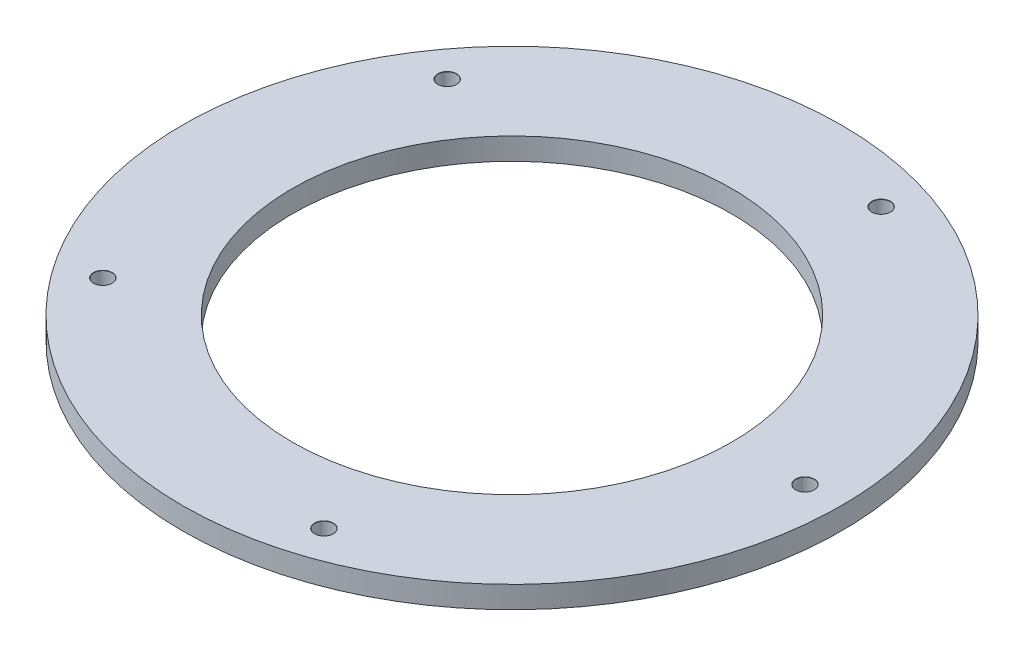
ISO-10303-21;
HEADER;
FILE_DESCRIPTION(('STEP AP214'),'2;1');
FILE_NAME('part.step','',(''),(''),'','','');
FILE_SCHEMA(('AUTOMOTIVE_DESIGN { 1 0 10303 214 1 1 1 1 }'));
ENDSEC;
DATA;
#1=APPLICATION_CONTEXT('core data for automotive mechanical design processes');
#2=APPLICATION_PROTOCOL_DEFINITION('international standard','automotive_design',2000,#1);
#3=PRODUCT_CONTEXT('',#1,'mechanical');
#4=PRODUCT('Part','Part','',(#3));
#5=PRODUCT_RELATED_PRODUCT_CATEGORY('part','',(#4));
#6=PRODUCT_DEFINITION_FORMATION('','',#4);
#7=PRODUCT_DEFINITION_CONTEXT('part definition',#1,'design');
#8=PRODUCT_DEFINITION('design','',#6,#7);
#9=PRODUCT_DEFINITION_SHAPE('','',#8);
#10=(LENGTH_UNIT() NAMED_UNIT(*) SI_UNIT(.MILLI.,.METRE.));
#11=(NAMED_UNIT(*) PLANE_ANGLE_UNIT() SI_UNIT($,.RADIAN.));
#12=(NAMED_UNIT(*) SI_UNIT($,.STERADIAN.) SOLID_ANGLE_UNIT());
#13=UNCERTAINTY_MEASURE_WITH_UNIT(LENGTH_MEASURE(1.E-05),#10,'distance_accuracy_value','');
#14=(GEOMETRIC_REPRESENTATION_CONTEXT(3) GLOBAL_UNCERTAINTY_ASSIGNED_CONTEXT((#13)) GLOBAL_UNIT_ASSIGNED_CONTEXT((#10,
#11,#12)) REPRESENTATION_CONTEXT('',''));
#15=CARTESIAN_POINT('',(0.,0.,0.));
#16=DIRECTION('',(0.,0.,1.));
#17=DIRECTION('',(1.,0.,0.));
#18=AXIS2_PLACEMENT_3D('',#15,#16,#17);
#19=CARTESIAN_POINT('',(0.,3.,0.));
#20=DIRECTION('',(0.,-1.,0.));
#21=DIRECTION('',(0.,0.,-1.));
#22=AXIS2_PLACEMENT_3D('',#19,#20,#21);
#23=CYLINDRICAL_SURFACE('',#22,45.);
#24=CARTESIAN_POINT('',(0.,3.,0.));
#25=DIRECTION('',(0.,1.,0.));
#26=DIRECTION('',(0.,0.,1.));
#27=AXIS2_PLACEMENT_3D('',#24,#25,#26);
#28=CIRCLE('',#27,45.);
#29=CARTESIAN_POINT('',(0.,3.,45.));
#30=VERTEX_POINT('',#29);
#31=EDGE_CURVE('E10',#30,#30,#28,.T.);
#32=ORIENTED_EDGE('',*,*,#31,.F.);
#33=EDGE_LOOP('',(#32));
#34=FACE_BOUND('',#33,.T.);
#35=CARTESIAN_POINT('',(0.,0.,0.));
#36=DIRECTION('',(0.,1.,0.));
#37=DIRECTION('',(0.,0.,1.));
#38=AXIS2_PLACEMENT_3D('',#35,#36,#37);
#39=CIRCLE('',#38,45.);
#40=CARTESIAN_POINT('',(0.,0.,45.));
#41=VERTEX_POINT('',#40);
#42=EDGE_CURVE('E44',#41,#41,#39,.T.);
#43=ORIENTED_EDGE('',*,*,#42,.T.);
#44=EDGE_LOOP('',(#43));
#45=FACE_BOUND('',#44,.T.);
#46=ADVANCED_FACE('F41',(#34,#45),#23,.T.);
#47=CARTESIAN_POINT('',(0.,3.,0.));
#48=DIRECTION('',(0.,1.,0.));
#49=DIRECTION('',(0.,0.,1.));
#50=AXIS2_PLACEMENT_3D('',#47,#48,#49);
#51=PLANE('',#50);
#52=CARTESIAN_POINT('',(40.,3.,0.));
#53=DIRECTION('',(0.,1.,0.));
#54=DIRECTION('',(0.,0.,1.));
#55=AXIS2_PLACEMENT_3D('',#52,#53,#54);
#56=CIRCLE('',#55,1.275);
#57=CARTESIAN_POINT('',(40.,3.,1.275));
#58=VERTEX_POINT('',#57);
#59=EDGE_CURVE('E100',#58,#58,#56,.T.);
#60=ORIENTED_EDGE('',*,*,#59,.F.);
#61=EDGE_LOOP('',(#60));
#62=FACE_BOUND('',#61,.T.);
#63=CARTESIAN_POINT('',(12.3606797749979,3.,38.0422606518062));
#64=DIRECTION('',(0.,1.,0.));
#65=DIRECTION('',(0.,0.,1.));
#66=AXIS2_PLACEMENT_3D('',#63,#64,#65);
#67=CIRCLE('',#66,1.275);
#68=CARTESIAN_POINT('',(12.3606797749979,3.,39.3172606518062));
#69=VERTEX_POINT('',#68);
#70=EDGE_CURVE('E91',#69,#69,#67,.T.);
#71=ORIENTED_EDGE('',*,*,#70,.F.);
#72=EDGE_LOOP('',(#71));
#73=FACE_BOUND('',#72,.T.);
#74=CARTESIAN_POINT('',(-32.3606797749979,3.,23.5114100916989));
#75=DIRECTION('',(0.,1.,0.));
#76=DIRECTION('',(0.,0.,1.));
#77=AXIS2_PLACEMENT_3D('',#74,#75,#76);
#78=CIRCLE('',#77,1.275);
#79=CARTESIAN_POINT('',(-32.3606797749979,3.,24.7864100916989));
#80=VERTEX_POINT('',#79);
#81=EDGE_CURVE('E82',#80,#80,#78,.T.);
#82=ORIENTED_EDGE('',*,*,#81,.F.);
#83=EDGE_LOOP('',(#82));
#84=FACE_BOUND('',#83,.T.);
#85=CARTESIAN_POINT('',(-32.3606797749979,3.,-23.5114100916989));
#86=DIRECTION('',(0.,1.,0.));
#87=DIRECTION('',(0.,0.,1.));
#88=AXIS2_PLACEMENT_3D('',#85,#86,#87);
#89=CIRCLE('',#88,1.275);
#90=CARTESIAN_POINT('',(-32.3606797749979,3.,-22.2364100916989));
#91=VERTEX_POINT('',#90);
#92=EDGE_CURVE('E73',#91,#91,#89,.T.);
#93=ORIENTED_EDGE('',*,*,#92,.F.);
#94=EDGE_LOOP('',(#93));
#95=FACE_BOUND('',#94,.T.);
#96=CARTESIAN_POINT('',(12.3606797749979,3.,-38.0422606518062));
#97=DIRECTION('',(0.,1.,0.));
#98=DIRECTION('',(0.,0.,1.));
#99=AXIS2_PLACEMENT_3D('',#96,#97,#98);
#100=CIRCLE('',#99,1.275);
#101=CARTESIAN_POINT('',(12.3606797749979,3.,-36.7672606518062));
#102=VERTEX_POINT('',#101);
#103=EDGE_CURVE('E64',#102,#102,#100,.T.);
#104=ORIENTED_EDGE('',*,*,#103,.F.);
#105=EDGE_LOOP('',(#104));
#106=FACE_BOUND('',#105,.T.);
#107=CARTESIAN_POINT('',(0.,3.,0.));
#108=DIRECTION('',(0.,1.,0.));
#109=DIRECTION('',(0.,0.,1.));
#110=AXIS2_PLACEMENT_3D('',#107,#108,#109);
#111=CIRCLE('',#110,30.);
#112=CARTESIAN_POINT('',(0.,3.,30.));
#113=VERTEX_POINT('',#112);
#114=EDGE_CURVE('E51',#113,#113,#111,.T.);
#115=ORIENTED_EDGE('',*,*,#114,.F.);
#116=EDGE_LOOP('',(#115));
#117=FACE_BOUND('',#116,.T.);
#118=ORIENTED_EDGE('',*,*,#31,.T.);
#119=EDGE_LOOP('',(#118));
#120=FACE_BOUND('',#119,.T.);
#121=ADVANCED_FACE('F106',(#62,#73,#84,#95,#106,#117,#120),#51,.T.);
#122=CARTESIAN_POINT('',(0.,0.,0.));
#123=DIRECTION('',(0.,1.,0.));
#124=DIRECTION('',(0.,0.,1.));
#125=AXIS2_PLACEMENT_3D('',#122,#123,#124);
#126=PLANE('',#125);
#127=CARTESIAN_POINT('',(40.,0.,0.));
#128=DIRECTION('',(0.,1.,0.));
#129=DIRECTION('',(0.,0.,1.));
#130=AXIS2_PLACEMENT_3D('',#127,#128,#129);
#131=CIRCLE('',#130,1.25);
#132=CARTESIAN_POINT('',(40.,0.,1.25));
#133=VERTEX_POINT('',#132);
#134=EDGE_CURVE('E94',#133,#133,#131,.T.);
#135=ORIENTED_EDGE('',*,*,#134,.T.);
#136=EDGE_LOOP('',(#135));
#137=FACE_BOUND('',#136,.T.);
#138=CARTESIAN_POINT('',(12.3606797749979,0.,38.0422606518062));
#139=DIRECTION('',(0.,1.,0.));
#140=DIRECTION('',(0.,0.,1.));
#141=AXIS2_PLACEMENT_3D('',#138,#139,#140);
#142=CIRCLE('',#141,1.25);
#143=CARTESIAN_POINT('',(12.3606797749979,0.,39.2922606518062));
#144=VERTEX_POINT('',#143);
#145=EDGE_CURVE('E85',#144,#144,#142,.T.);
#146=ORIENTED_EDGE('',*,*,#145,.T.);
#147=EDGE_LOOP('',(#146));
#148=FACE_BOUND('',#147,.T.);
#149=CARTESIAN_POINT('',(-32.3606797749979,0.,23.5114100916989));
#150=DIRECTION('',(0.,1.,0.));
#151=DIRECTION('',(0.,0.,1.));
#152=AXIS2_PLACEMENT_3D('',#149,#150,#151);
#153=CIRCLE('',#152,1.25);
#154=CARTESIAN_POINT('',(-32.3606797749979,0.,24.7614100916989));
#155=VERTEX_POINT('',#154);
#156=EDGE_CURVE('E76',#155,#155,#153,.T.);
#157=ORIENTED_EDGE('',*,*,#156,.T.);
#158=EDGE_LOOP('',(#157));
#159=FACE_BOUND('',#158,.T.);
#160=CARTESIAN_POINT('',(-32.3606797749979,0.,-23.5114100916989));
#161=DIRECTION('',(0.,1.,0.));
#162=DIRECTION('',(0.,0.,1.));
#163=AXIS2_PLACEMENT_3D('',#160,#161,#162);
#164=CIRCLE('',#163,1.25);
#165=CARTESIAN_POINT('',(-32.3606797749979,0.,-22.2614100916989));
#166=VERTEX_POINT('',#165);
#167=EDGE_CURVE('E67',#166,#166,#164,.T.);
#168=ORIENTED_EDGE('',*,*,#167,.T.);
#169=EDGE_LOOP('',(#168));
#170=FACE_BOUND('',#169,.T.);
#171=CARTESIAN_POINT('',(12.3606797749979,0.,-38.0422606518062));
#172=DIRECTION('',(0.,1.,0.));
#173=DIRECTION('',(0.,0.,1.));
#174=AXIS2_PLACEMENT_3D('',#171,#172,#173);
#175=CIRCLE('',#174,1.25);
#176=CARTESIAN_POINT('',(12.3606797749979,0.,-36.7922606518062));
#177=VERTEX_POINT('',#176);
#178=EDGE_CURVE('E58',#177,#177,#175,.T.);
#179=ORIENTED_EDGE('',*,*,#178,.T.);
#180=EDGE_LOOP('',(#179));
#181=FACE_BOUND('',#180,.T.);
#182=CARTESIAN_POINT('',(0.,0.,0.));
#183=DIRECTION('',(0.,1.,0.));
#184=DIRECTION('',(0.,0.,1.));
#185=AXIS2_PLACEMENT_3D('',#182,#183,#184);
#186=CIRCLE('',#185,30.);
#187=CARTESIAN_POINT('',(0.,0.,30.));
#188=VERTEX_POINT('',#187);
#189=EDGE_CURVE('E55',#188,#188,#186,.T.);
#190=ORIENTED_EDGE('',*,*,#189,.T.);
#191=EDGE_LOOP('',(#190));
#192=FACE_BOUND('',#191,.T.);
#193=ORIENTED_EDGE('',*,*,#42,.F.);
#194=EDGE_LOOP('',(#193));
#195=FACE_BOUND('',#194,.T.);
#196=ADVANCED_FACE('F109',(#137,#148,#159,#170,#181,#192,#195),#126,.F.);
#197=CARTESIAN_POINT('',(0.,0.,0.));
#198=DIRECTION('',(0.,1.,0.));
#199=DIRECTION('',(0.,0.,1.));
#200=AXIS2_PLACEMENT_3D('',#197,#198,#199);
#201=CYLINDRICAL_SURFACE('',#200,30.);
#202=ORIENTED_EDGE('',*,*,#114,.T.);
#203=EDGE_LOOP('',(#202));
#204=FACE_BOUND('',#203,.T.);
#205=ORIENTED_EDGE('',*,*,#189,.F.);
#206=EDGE_LOOP('',(#205));
#207=FACE_BOUND('',#206,.T.);
#208=ADVANCED_FACE('F121',(#204,#207),#201,.F.);
#209=CARTESIAN_POINT('',(12.3606797749979,3.,-38.0422606518062));
#210=DIRECTION('',(0.,1.,0.));
#211=DIRECTION('',(0.,0.,1.));
#212=AXIS2_PLACEMENT_3D('',#209,#210,#211);
#213=CYLINDRICAL_SURFACE('',#212,1.25);
#214=ORIENTED_EDGE('',*,*,#178,.F.);
#215=EDGE_LOOP('',(#214));
#216=FACE_BOUND('',#215,.T.);
#217=CARTESIAN_POINT('',(12.3606797749979,2.975,-38.0422606518062));
#218=DIRECTION('',(0.,1.,0.));
#219=DIRECTION('',(0.,0.,1.));
#220=AXIS2_PLACEMENT_3D('',#217,#218,#219);
#221=CIRCLE('',#220,1.25);
#222=CARTESIAN_POINT('',(12.3606797749979,2.975,-36.7922606518062));
#223=VERTEX_POINT('',#222);
#224=EDGE_CURVE('E61',#223,#223,#221,.T.);
#225=ORIENTED_EDGE('',*,*,#224,.T.);
#226=EDGE_LOOP('',(#225));
#227=FACE_BOUND('',#226,.T.);
#228=ADVANCED_FACE('F124',(#216,#227),#213,.F.);
#229=CARTESIAN_POINT('',(12.3606797749979,3.,-38.0422606518062));
#230=DIRECTION('',(0.,1.,0.));
#231=DIRECTION('',(0.,0.,1.));
#232=AXIS2_PLACEMENT_3D('',#229,#230,#231);
#233=CONICAL_SURFACE('',#232,1.275,0.785398163397457);
#234=ORIENTED_EDGE('',*,*,#224,.F.);
#235=EDGE_LOOP('',(#234));
#236=FACE_BOUND('',#235,.T.);
#237=ORIENTED_EDGE('',*,*,#103,.T.);
#238=EDGE_LOOP('',(#237));
#239=FACE_BOUND('',#238,.T.);
#240=ADVANCED_FACE('F155',(#236,#239),#233,.F.);
#241=CARTESIAN_POINT('',(-32.3606797749979,3.,-23.5114100916989));
#242=DIRECTION('',(0.,1.,0.));
#243=DIRECTION('',(0.,0.,1.));
#244=AXIS2_PLACEMENT_3D('',#241,#242,#243);
#245=CYLINDRICAL_SURFACE('',#244,1.25);
#246=ORIENTED_EDGE('',*,*,#167,.F.);
#247=EDGE_LOOP('',(#246));
#248=FACE_BOUND('',#247,.T.);
#249=CARTESIAN_POINT('',(-32.3606797749979,2.975,-23.5114100916989));
#250=DIRECTION('',(0.,1.,0.));
#251=DIRECTION('',(0.,0.,1.));
#252=AXIS2_PLACEMENT_3D('',#249,#250,#251);
#253=CIRCLE('',#252,1.25);
#254=CARTESIAN_POINT('',(-32.3606797749979,2.975,-22.2614100916989));
#255=VERTEX_POINT('',#254);
#256=EDGE_CURVE('E70',#255,#255,#253,.T.);
#257=ORIENTED_EDGE('',*,*,#256,.T.);
#258=EDGE_LOOP('',(#257));
#259=FACE_BOUND('',#258,.T.);
#260=ADVANCED_FACE('F163',(#248,#259),#245,.F.);
#261=CARTESIAN_POINT('',(-32.3606797749979,3.,-23.5114100916989));
#262=DIRECTION('',(0.,1.,0.));
#263=DIRECTION('',(0.,0.,1.));
#264=AXIS2_PLACEMENT_3D('',#261,#262,#263);
#265=CONICAL_SURFACE('',#264,1.275,0.785398163397388);
#266=ORIENTED_EDGE('',*,*,#256,.F.);
#267=EDGE_LOOP('',(#266));
#268=FACE_BOUND('',#267,.T.);
#269=ORIENTED_EDGE('',*,*,#92,.T.);
#270=EDGE_LOOP('',(#269));
#271=FACE_BOUND('',#270,.T.);
#272=ADVANCED_FACE('F171',(#268,#271),#265,.F.);
#273=CARTESIAN_POINT('',(-32.3606797749979,3.,23.5114100916989));
#274=DIRECTION('',(0.,1.,0.));
#275=DIRECTION('',(0.,0.,1.));
#276=AXIS2_PLACEMENT_3D('',#273,#274,#275);
#277=CYLINDRICAL_SURFACE('',#276,1.25);
#278=ORIENTED_EDGE('',*,*,#156,.F.);
#279=EDGE_LOOP('',(#278));
#280=FACE_BOUND('',#279,.T.);
#281=CARTESIAN_POINT('',(-32.3606797749979,2.975,23.5114100916989));
#282=DIRECTION('',(0.,1.,0.));
#283=DIRECTION('',(0.,0.,1.));
#284=AXIS2_PLACEMENT_3D('',#281,#282,#283);
#285=CIRCLE('',#284,1.25);
#286=CARTESIAN_POINT('',(-32.3606797749979,2.975,24.7614100916989));
#287=VERTEX_POINT('',#286);
#288=EDGE_CURVE('E79',#287,#287,#285,.T.);
#289=ORIENTED_EDGE('',*,*,#288,.T.);
#290=EDGE_LOOP('',(#289));
#291=FACE_BOUND('',#290,.T.);
#292=ADVANCED_FACE('F179',(#280,#291),#277,.F.);
#293=CARTESIAN_POINT('',(-32.3606797749979,3.,23.5114100916989));
#294=DIRECTION('',(0.,1.,0.));
#295=DIRECTION('',(0.,0.,1.));
#296=AXIS2_PLACEMENT_3D('',#293,#294,#295);
#297=CONICAL_SURFACE('',#296,1.275,0.785398163397388);
#298=ORIENTED_EDGE('',*,*,#288,.F.);
#299=EDGE_LOOP('',(#298));
#300=FACE_BOUND('',#299,.T.);
#301=ORIENTED_EDGE('',*,*,#81,.T.);
#302=EDGE_LOOP('',(#301));
#303=FACE_BOUND('',#302,.T.);
#304=ADVANCED_FACE('F187',(#300,#303),#297,.F.);
#305=CARTESIAN_POINT('',(12.3606797749979,3.,38.0422606518062));
#306=DIRECTION('',(0.,1.,0.));
#307=DIRECTION('',(0.,0.,1.));
#308=AXIS2_PLACEMENT_3D('',#305,#306,#307);
#309=CYLINDRICAL_SURFACE('',#308,1.25);
#310=ORIENTED_EDGE('',*,*,#145,.F.);
#311=EDGE_LOOP('',(#310));
#312=FACE_BOUND('',#311,.T.);
#313=CARTESIAN_POINT('',(12.3606797749979,2.975,38.0422606518062));
#314=DIRECTION('',(0.,1.,0.));
#315=DIRECTION('',(0.,0.,1.));
#316=AXIS2_PLACEMENT_3D('',#313,#314,#315);
#317=CIRCLE('',#316,1.25);
#318=CARTESIAN_POINT('',(12.3606797749979,2.975,39.2922606518062));
#319=VERTEX_POINT('',#318);
#320=EDGE_CURVE('E88',#319,#319,#317,.T.);
#321=ORIENTED_EDGE('',*,*,#320,.T.);
#322=EDGE_LOOP('',(#321));
#323=FACE_BOUND('',#322,.T.);
#324=ADVANCED_FACE('F195',(#312,#323),#309,.F.);
#325=CARTESIAN_POINT('',(12.3606797749979,3.,38.0422606518062));
#326=DIRECTION('',(0.,1.,0.));
#327=DIRECTION('',(0.,0.,1.));
#328=AXIS2_PLACEMENT_3D('',#325,#326,#327);
#329=CONICAL_SURFACE('',#328,1.275,0.785398163397457);
#330=ORIENTED_EDGE('',*,*,#320,.F.);
#331=EDGE_LOOP('',(#330));
#332=FACE_BOUND('',#331,.T.);
#333=ORIENTED_EDGE('',*,*,#70,.T.);
#334=EDGE_LOOP('',(#333));
#335=FACE_BOUND('',#334,.T.);
#336=ADVANCED_FACE('F203',(#332,#335),#329,.F.);
#337=CARTESIAN_POINT('',(40.,3.,0.));
#338=DIRECTION('',(0.,1.,0.));
#339=DIRECTION('',(0.,0.,1.));
#340=AXIS2_PLACEMENT_3D('',#337,#338,#339);
#341=CYLINDRICAL_SURFACE('',#340,1.25);
#342=ORIENTED_EDGE('',*,*,#134,.F.);
#343=EDGE_LOOP('',(#342));
#344=FACE_BOUND('',#343,.T.);
#345=CARTESIAN_POINT('',(40.,2.975,0.));
#346=DIRECTION('',(0.,1.,0.));
#347=DIRECTION('',(0.,0.,1.));
#348=AXIS2_PLACEMENT_3D('',#345,#346,#347);
#349=CIRCLE('',#348,1.25);
#350=CARTESIAN_POINT('',(40.,2.975,1.25));
#351=VERTEX_POINT('',#350);
#352=EDGE_CURVE('E97',#351,#351,#349,.T.);
#353=ORIENTED_EDGE('',*,*,#352,.T.);
#354=EDGE_LOOP('',(#353));
#355=FACE_BOUND('',#354,.T.);
#356=ADVANCED_FACE('F211',(#344,#355),#341,.F.);
#357=CARTESIAN_POINT('',(40.,3.,0.));
#358=DIRECTION('',(0.,1.,0.));
#359=DIRECTION('',(0.,0.,1.));
#360=AXIS2_PLACEMENT_3D('',#357,#358,#359);
#361=CONICAL_SURFACE('',#360,1.275,0.785398163397388);
#362=ORIENTED_EDGE('',*,*,#352,.F.);
#363=EDGE_LOOP('',(#362));
#364=FACE_BOUND('',#363,.T.);
#365=ORIENTED_EDGE('',*,*,#59,.T.);
#366=EDGE_LOOP('',(#365));
#367=FACE_BOUND('',#366,.T.);
#368=ADVANCED_FACE('F104',(#364,#367),#361,.F.);
#369=CLOSED_SHELL('',(#46,#121,#196,#208,#228,#240,#260,#272,#292,#304,#324,#336,#356,#368));
#370=MANIFOLD_SOLID_BREP('B2',#369);
#371=ADVANCED_BREP_SHAPE_REPRESENTATION('',(#18,#370),#14);
#372=SHAPE_DEFINITION_REPRESENTATION(#9,#371);
ENDSEC;
END-ISO-10303-21;
